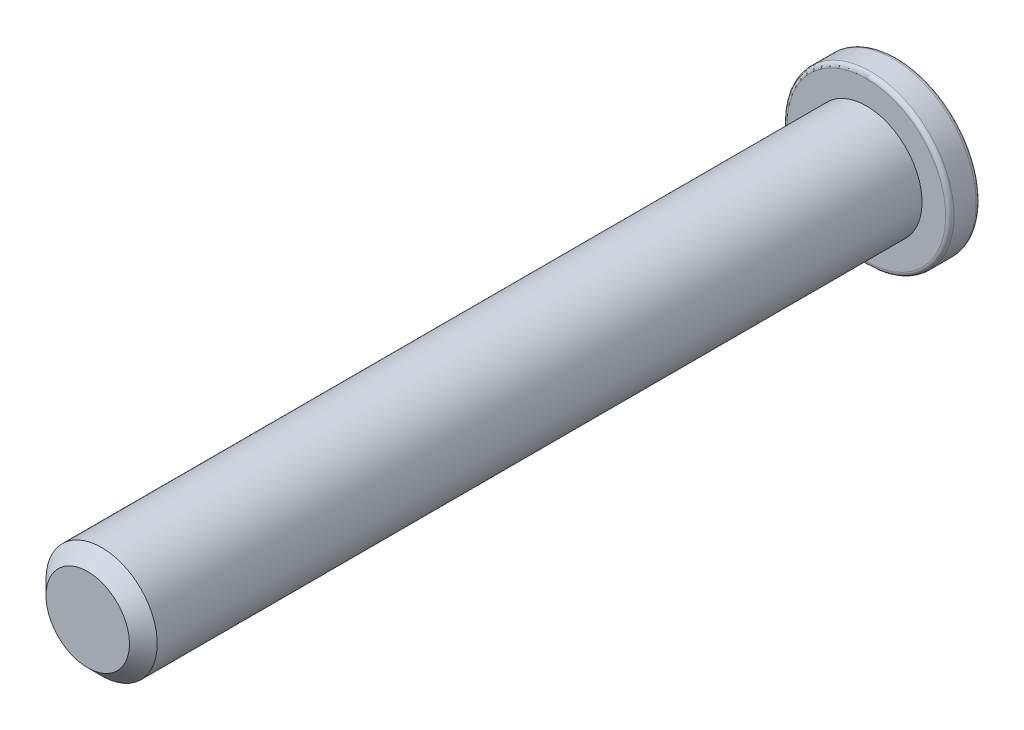
ISO-10303-21;
HEADER;
FILE_DESCRIPTION(('STEP AP214'),'2;1');
FILE_NAME('part.step','',(''),(''),'','','');
FILE_SCHEMA(('AUTOMOTIVE_DESIGN { 1 0 10303 214 1 1 1 1 }'));
ENDSEC;
DATA;
#1=APPLICATION_CONTEXT('core data for automotive mechanical design processes');
#2=APPLICATION_PROTOCOL_DEFINITION('international standard','automotive_design',2000,#1);
#3=PRODUCT_CONTEXT('',#1,'mechanical');
#4=PRODUCT('Part','Part','',(#3));
#5=PRODUCT_RELATED_PRODUCT_CATEGORY('part','',(#4));
#6=PRODUCT_DEFINITION_FORMATION('','',#4);
#7=PRODUCT_DEFINITION_CONTEXT('part definition',#1,'design');
#8=PRODUCT_DEFINITION('design','',#6,#7);
#9=PRODUCT_DEFINITION_SHAPE('','',#8);
#10=(LENGTH_UNIT() NAMED_UNIT(*) SI_UNIT(.MILLI.,.METRE.));
#11=(NAMED_UNIT(*) PLANE_ANGLE_UNIT() SI_UNIT($,.RADIAN.));
#12=(NAMED_UNIT(*) SI_UNIT($,.STERADIAN.) SOLID_ANGLE_UNIT());
#13=UNCERTAINTY_MEASURE_WITH_UNIT(LENGTH_MEASURE(1.E-05),#10,'distance_accuracy_value','');
#14=(GEOMETRIC_REPRESENTATION_CONTEXT(3) GLOBAL_UNCERTAINTY_ASSIGNED_CONTEXT((#13)) GLOBAL_UNIT_ASSIGNED_CONTEXT((#10,
#11,#12)) REPRESENTATION_CONTEXT('',''));
#15=CARTESIAN_POINT('',(0.,0.,0.));
#16=DIRECTION('',(0.,0.,1.));
#17=DIRECTION('',(1.,0.,0.));
#18=AXIS2_PLACEMENT_3D('',#15,#16,#17);
#19=CARTESIAN_POINT('',(-10.40000072,-11.25,-18.9584026755113));
#20=DIRECTION('',(-0.923879532511287,0.,-0.38268343236509));
#21=DIRECTION('',(-0.38268343236509,0.,0.923879532511287));
#22=AXIS2_PLACEMENT_3D('',#19,#20,#21);
#23=PLANE('',#22);
#24=DIRECTION('',(0.,1.,0.));
#25=VECTOR('',#24,1.);
#26=CARTESIAN_POINT('',(-10.8970569948477,-11.25,-17.7584026755113));
#27=LINE('',#26,#25);
#28=CARTESIAN_POINT('',(-10.8970569948477,-11.3660878256678,-17.7584026755113));
#29=VERTEX_POINT('',#28);
#30=CARTESIAN_POINT('',(-10.8970569948477,-11.1339121743322,-17.7584026755113));
#31=VERTEX_POINT('',#30);
#32=EDGE_CURVE('E117',#29,#31,#27,.T.);
#33=ORIENTED_EDGE('',*,*,#32,.T.);
#34=DIRECTION('',(-0.381887326256781,-0.0644695530821724,0.921957562347547));
#35=VECTOR('',#34,1.);
#36=CARTESIAN_POINT('',(-10.40000072,-11.05,-18.9584026755113));
#37=LINE('',#36,#35);
#38=CARTESIAN_POINT('',(-10.40000072,-11.05,-18.9584026755113));
#39=VERTEX_POINT('',#38);
#40=EDGE_CURVE('E133',#39,#31,#37,.T.);
#41=ORIENTED_EDGE('',*,*,#40,.F.);
#42=DIRECTION('',(0.,1.,0.));
#43=VECTOR('',#42,1.);
#44=CARTESIAN_POINT('',(-10.40000072,-11.25,-18.9584026755113));
#45=LINE('',#44,#43);
#46=CARTESIAN_POINT('',(-10.40000072,-11.45,-18.9584026755113));
#47=VERTEX_POINT('',#46);
#48=EDGE_CURVE('E122',#39,#47,#45,.F.);
#49=ORIENTED_EDGE('',*,*,#48,.T.);
#50=DIRECTION('',(0.381887326256781,-0.0644695530821737,-0.921957562347547));
#51=VECTOR('',#50,1.);
#52=CARTESIAN_POINT('',(-10.8970569948477,-11.3660878256678,-17.7584026755113));
#53=LINE('',#52,#51);
#54=EDGE_CURVE('E286',#29,#47,#53,.T.);
#55=ORIENTED_EDGE('',*,*,#54,.F.);
#56=EDGE_LOOP('',(#33,#41,#49,#55));
#57=FACE_BOUND('',#56,.T.);
#58=ADVANCED_FACE('F17',(#57),#23,.T.);
#59=CARTESIAN_POINT('',(-11.25000072,-11.05,-18.9584026755113));
#60=DIRECTION('',(0.,-0.997564050259824,-0.0697564737441253));
#61=DIRECTION('',(0.,0.0697564737441253,-0.997564050259824));
#62=AXIS2_PLACEMENT_3D('',#59,#60,#61);
#63=PLANE('',#62);
#64=DIRECTION('',(1.,0.,0.));
#65=VECTOR('',#64,1.);
#66=CARTESIAN_POINT('',(-11.25000072,-11.1339121743322,-17.7584026755113));
#67=LINE('',#66,#65);
#68=CARTESIAN_POINT('',(-11.1339128943322,-11.1339121743322,-17.7584026755113));
#69=VERTEX_POINT('',#68);
#70=EDGE_CURVE('E135',#31,#69,#67,.F.);
#71=ORIENTED_EDGE('',*,*,#70,.T.);
#72=DIRECTION('',(-0.0695873743166642,-0.0695873743166541,0.995145815783509));
#73=VECTOR('',#72,1.);
#74=CARTESIAN_POINT('',(-11.05000072,-11.05,-18.9584026755113));
#75=LINE('',#74,#73);
#76=CARTESIAN_POINT('',(-11.05000072,-11.05,-18.9584026755113));
#77=VERTEX_POINT('',#76);
#78=EDGE_CURVE('E139',#77,#69,#75,.T.);
#79=ORIENTED_EDGE('',*,*,#78,.F.);
#80=DIRECTION('',(1.,0.,0.));
#81=VECTOR('',#80,1.);
#82=CARTESIAN_POINT('',(-11.25000072,-11.05,-18.9584026755113));
#83=LINE('',#82,#81);
#84=EDGE_CURVE('E126',#77,#39,#83,.T.);
#85=ORIENTED_EDGE('',*,*,#84,.T.);
#86=ORIENTED_EDGE('',*,*,#40,.T.);
#87=EDGE_LOOP('',(#71,#79,#85,#86));
#88=FACE_BOUND('',#87,.T.);
#89=ADVANCED_FACE('F137',(#88),#63,.T.);
#90=CARTESIAN_POINT('',(-11.25000072,-11.45,-18.9584026755113));
#91=DIRECTION('',(0.,0.997564050259824,-0.0697564737441253));
#92=DIRECTION('',(0.,0.0697564737441253,0.997564050259824));
#93=AXIS2_PLACEMENT_3D('',#90,#91,#92);
#94=PLANE('',#93);
#95=DIRECTION('',(1.,0.,0.));
#96=VECTOR('',#95,1.);
#97=CARTESIAN_POINT('',(-11.25000072,-11.3660878256678,-17.7584026755113));
#98=LINE('',#97,#96);
#99=CARTESIAN_POINT('',(-11.1339128943322,-11.3660878256678,-17.7584026755113));
#100=VERTEX_POINT('',#99);
#101=EDGE_CURVE('E288',#100,#29,#98,.T.);
#102=ORIENTED_EDGE('',*,*,#101,.T.);
#103=ORIENTED_EDGE('',*,*,#54,.T.);
#104=DIRECTION('',(1.,0.,0.));
#105=VECTOR('',#104,1.);
#106=CARTESIAN_POINT('',(-11.25000072,-11.45,-18.9584026755113));
#107=LINE('',#106,#105);
#108=CARTESIAN_POINT('',(-11.05000072,-11.45,-18.9584026755113));
#109=VERTEX_POINT('',#108);
#110=EDGE_CURVE('E129',#47,#109,#107,.F.);
#111=ORIENTED_EDGE('',*,*,#110,.T.);
#112=DIRECTION('',(0.0695873743166642,-0.0695873743166541,-0.995145815783509));
#113=VECTOR('',#112,1.);
#114=CARTESIAN_POINT('',(-11.1339128943322,-11.3660878256678,-17.7584026755113));
#115=LINE('',#114,#113);
#116=EDGE_CURVE('E272',#100,#109,#115,.T.);
#117=ORIENTED_EDGE('',*,*,#116,.F.);
#118=EDGE_LOOP('',(#102,#103,#111,#117));
#119=FACE_BOUND('',#118,.T.);
#120=ADVANCED_FACE('F459',(#119),#94,.T.);
#121=CARTESIAN_POINT('',(-11.05000072,-11.25,-18.9584026755113));
#122=DIRECTION('',(-0.997564050259824,0.,-0.0697564737441253));
#123=DIRECTION('',(-0.0697564737441253,0.,0.997564050259824));
#124=AXIS2_PLACEMENT_3D('',#121,#122,#123);
#125=PLANE('',#124);
#126=DIRECTION('',(0.,1.,0.));
#127=VECTOR('',#126,1.);
#128=CARTESIAN_POINT('',(-11.1339128943322,-11.25,-17.7584026755113));
#129=LINE('',#128,#127);
#130=CARTESIAN_POINT('',(-11.1339128943322,-10.8970562748477,-17.7584026755113));
#131=VERTEX_POINT('',#130);
#132=EDGE_CURVE('E281',#69,#131,#129,.T.);
#133=ORIENTED_EDGE('',*,*,#132,.T.);
#134=DIRECTION('',(-0.0644695530821645,-0.381887326256792,0.921957562347544));
#135=VECTOR('',#134,1.);
#136=CARTESIAN_POINT('',(-11.05000072,-10.4,-18.9584026755113));
#137=LINE('',#136,#135);
#138=CARTESIAN_POINT('',(-11.05000072,-10.4,-18.9584026755113));
#139=VERTEX_POINT('',#138);
#140=EDGE_CURVE('E266',#139,#131,#137,.T.);
#141=ORIENTED_EDGE('',*,*,#140,.F.);
#142=DIRECTION('',(0.,1.,0.));
#143=VECTOR('',#142,1.);
#144=CARTESIAN_POINT('',(-11.05000072,-11.25,-18.9584026755113));
#145=LINE('',#144,#143);
#146=EDGE_CURVE('E284',#139,#77,#145,.F.);
#147=ORIENTED_EDGE('',*,*,#146,.T.);
#148=ORIENTED_EDGE('',*,*,#78,.T.);
#149=EDGE_LOOP('',(#133,#141,#147,#148));
#150=FACE_BOUND('',#149,.T.);
#151=ADVANCED_FACE('F298',(#150),#125,.T.);
#152=CARTESIAN_POINT('',(-11.05000072,-11.25,-18.9584026755113));
#153=DIRECTION('',(-0.997564050259824,0.,-0.0697564737441253));
#154=DIRECTION('',(-0.0697564737441253,0.,0.997564050259824));
#155=AXIS2_PLACEMENT_3D('',#152,#153,#154);
#156=PLANE('',#155);
#157=DIRECTION('',(0.,1.,0.));
#158=VECTOR('',#157,1.);
#159=CARTESIAN_POINT('',(-11.1339128943322,-11.25,-17.7584026755113));
#160=LINE('',#159,#158);
#161=CARTESIAN_POINT('',(-11.1339128943322,-11.6029437251523,-17.7584026755113));
#162=VERTEX_POINT('',#161);
#163=EDGE_CURVE('E275',#162,#100,#160,.T.);
#164=ORIENTED_EDGE('',*,*,#163,.T.);
#165=ORIENTED_EDGE('',*,*,#116,.T.);
#166=DIRECTION('',(0.,1.,0.));
#167=VECTOR('',#166,1.);
#168=CARTESIAN_POINT('',(-11.05000072,-11.25,-18.9584026755113));
#169=LINE('',#168,#167);
#170=CARTESIAN_POINT('',(-11.05000072,-12.1,-18.9584026755113));
#171=VERTEX_POINT('',#170);
#172=EDGE_CURVE('E278',#109,#171,#169,.F.);
#173=ORIENTED_EDGE('',*,*,#172,.T.);
#174=DIRECTION('',(0.0644695530821645,-0.381887326256792,-0.921957562347544));
#175=VECTOR('',#174,1.);
#176=CARTESIAN_POINT('',(-11.1339128943322,-11.6029437251523,-17.7584026755113));
#177=LINE('',#176,#175);
#178=EDGE_CURVE('E255',#162,#171,#177,.T.);
#179=ORIENTED_EDGE('',*,*,#178,.F.);
#180=EDGE_LOOP('',(#164,#165,#173,#179));
#181=FACE_BOUND('',#180,.T.);
#182=ADVANCED_FACE('F445',(#181),#156,.T.);
#183=CARTESIAN_POINT('',(-11.25000072,-10.4,-18.9584026755113));
#184=DIRECTION('',(0.,-0.923879532511287,-0.38268343236509));
#185=DIRECTION('',(0.,0.38268343236509,-0.923879532511287));
#186=AXIS2_PLACEMENT_3D('',#183,#184,#185);
#187=PLANE('',#186);
#188=DIRECTION('',(1.,0.,0.));
#189=VECTOR('',#188,1.);
#190=CARTESIAN_POINT('',(-11.25000072,-10.8970562748477,-17.7584026755113));
#191=LINE('',#190,#189);
#192=CARTESIAN_POINT('',(-11.3660885456678,-10.8970562748477,-17.7584026755113));
#193=VERTEX_POINT('',#192);
#194=EDGE_CURVE('E264',#131,#193,#191,.F.);
#195=ORIENTED_EDGE('',*,*,#194,.T.);
#196=DIRECTION('',(0.0644695530821724,-0.381887326256779,0.921957562347548));
#197=VECTOR('',#196,1.);
#198=CARTESIAN_POINT('',(-11.45000072,-10.4,-18.9584026755113));
#199=LINE('',#198,#197);
#200=CARTESIAN_POINT('',(-11.45000072,-10.4,-18.9584026755113));
#201=VERTEX_POINT('',#200);
#202=EDGE_CURVE('E249',#201,#193,#199,.T.);
#203=ORIENTED_EDGE('',*,*,#202,.F.);
#204=DIRECTION('',(1.,0.,0.));
#205=VECTOR('',#204,1.);
#206=CARTESIAN_POINT('',(-11.25000072,-10.4,-18.9584026755113));
#207=LINE('',#206,#205);
#208=EDGE_CURVE('E269',#201,#139,#207,.T.);
#209=ORIENTED_EDGE('',*,*,#208,.T.);
#210=ORIENTED_EDGE('',*,*,#140,.T.);
#211=EDGE_LOOP('',(#195,#203,#209,#210));
#212=FACE_BOUND('',#211,.T.);
#213=ADVANCED_FACE('F302',(#212),#187,.T.);
#214=CARTESIAN_POINT('',(-11.25000072,-12.1,-18.9584026755113));
#215=DIRECTION('',(0.,0.923879532511287,-0.38268343236509));
#216=DIRECTION('',(0.,0.38268343236509,0.923879532511287));
#217=AXIS2_PLACEMENT_3D('',#214,#215,#216);
#218=PLANE('',#217);
#219=DIRECTION('',(1.,0.,0.));
#220=VECTOR('',#219,1.);
#221=CARTESIAN_POINT('',(-11.25000072,-11.6029437251523,-17.7584026755113));
#222=LINE('',#221,#220);
#223=CARTESIAN_POINT('',(-11.3660885456678,-11.6029437251523,-17.7584026755113));
#224=VERTEX_POINT('',#223);
#225=EDGE_CURVE('E258',#224,#162,#222,.T.);
#226=ORIENTED_EDGE('',*,*,#225,.T.);
#227=ORIENTED_EDGE('',*,*,#178,.T.);
#228=DIRECTION('',(1.,0.,0.));
#229=VECTOR('',#228,1.);
#230=CARTESIAN_POINT('',(-11.25000072,-12.1,-18.9584026755113));
#231=LINE('',#230,#229);
#232=CARTESIAN_POINT('',(-11.45000072,-12.1,-18.9584026755113));
#233=VERTEX_POINT('',#232);
#234=EDGE_CURVE('E261',#171,#233,#231,.F.);
#235=ORIENTED_EDGE('',*,*,#234,.T.);
#236=DIRECTION('',(-0.0644695530821738,-0.38188732625678,-0.921957562347548));
#237=VECTOR('',#236,1.);
#238=CARTESIAN_POINT('',(-11.3660885456678,-11.6029437251523,-17.7584026755113));
#239=LINE('',#238,#237);
#240=EDGE_CURVE('E241',#224,#233,#239,.T.);
#241=ORIENTED_EDGE('',*,*,#240,.F.);
#242=EDGE_LOOP('',(#226,#227,#235,#241));
#243=FACE_BOUND('',#242,.T.);
#244=ADVANCED_FACE('F431',(#243),#218,.T.);
#245=CARTESIAN_POINT('',(-11.45000072,-11.25,-18.9584026755113));
#246=DIRECTION('',(0.997564050259824,0.,-0.0697564737441253));
#247=DIRECTION('',(-0.0697564737441253,0.,-0.997564050259824));
#248=AXIS2_PLACEMENT_3D('',#245,#246,#247);
#249=PLANE('',#248);
#250=DIRECTION('',(0.,1.,0.));
#251=VECTOR('',#250,1.);
#252=CARTESIAN_POINT('',(-11.3660885456678,-11.25,-17.7584026755113));
#253=LINE('',#252,#251);
#254=CARTESIAN_POINT('',(-11.3660885456678,-11.1339121743322,-17.7584026755113));
#255=VERTEX_POINT('',#254);
#256=EDGE_CURVE('E247',#193,#255,#253,.F.);
#257=ORIENTED_EDGE('',*,*,#256,.T.);
#258=DIRECTION('',(0.0695873743166541,-0.0695873743166642,0.995145815783509));
#259=VECTOR('',#258,1.);
#260=CARTESIAN_POINT('',(-11.45000072,-11.05,-18.9584026755113));
#261=LINE('',#260,#259);
#262=CARTESIAN_POINT('',(-11.45000072,-11.05,-18.9584026755113));
#263=VERTEX_POINT('',#262);
#264=EDGE_CURVE('E235',#263,#255,#261,.T.);
#265=ORIENTED_EDGE('',*,*,#264,.F.);
#266=DIRECTION('',(0.,1.,0.));
#267=VECTOR('',#266,1.);
#268=CARTESIAN_POINT('',(-11.45000072,-11.25,-18.9584026755113));
#269=LINE('',#268,#267);
#270=EDGE_CURVE('E252',#263,#201,#269,.T.);
#271=ORIENTED_EDGE('',*,*,#270,.T.);
#272=ORIENTED_EDGE('',*,*,#202,.T.);
#273=EDGE_LOOP('',(#257,#265,#271,#272));
#274=FACE_BOUND('',#273,.T.);
#275=ADVANCED_FACE('F304',(#274),#249,.T.);
#276=CARTESIAN_POINT('',(-11.45000072,-11.25,-18.9584026755113));
#277=DIRECTION('',(0.997564050259824,0.,-0.0697564737441253));
#278=DIRECTION('',(-0.0697564737441253,0.,-0.997564050259824));
#279=AXIS2_PLACEMENT_3D('',#276,#277,#278);
#280=PLANE('',#279);
#281=DIRECTION('',(0.,1.,0.));
#282=VECTOR('',#281,1.);
#283=CARTESIAN_POINT('',(-11.3660885456678,-11.25,-17.7584026755113));
#284=LINE('',#283,#282);
#285=CARTESIAN_POINT('',(-11.3660885456678,-11.3660878256678,-17.7584026755113));
#286=VERTEX_POINT('',#285);
#287=EDGE_CURVE('E230',#224,#286,#284,.T.);
#288=ORIENTED_EDGE('',*,*,#287,.F.);
#289=ORIENTED_EDGE('',*,*,#240,.T.);
#290=DIRECTION('',(0.,1.,0.));
#291=VECTOR('',#290,1.);
#292=CARTESIAN_POINT('',(-11.45000072,-11.25,-18.9584026755113));
#293=LINE('',#292,#291);
#294=CARTESIAN_POINT('',(-11.45000072,-11.45,-18.9584026755113));
#295=VERTEX_POINT('',#294);
#296=EDGE_CURVE('E244',#233,#295,#293,.T.);
#297=ORIENTED_EDGE('',*,*,#296,.T.);
#298=DIRECTION('',(-0.0695873743166541,-0.0695873743166642,-0.995145815783509));
#299=VECTOR('',#298,1.);
#300=CARTESIAN_POINT('',(-11.3660885456678,-11.3660878256678,-17.7584026755113));
#301=LINE('',#300,#299);
#302=EDGE_CURVE('E222',#286,#295,#301,.T.);
#303=ORIENTED_EDGE('',*,*,#302,.F.);
#304=EDGE_LOOP('',(#288,#289,#297,#303));
#305=FACE_BOUND('',#304,.T.);
#306=ADVANCED_FACE('F417',(#305),#280,.T.);
#307=CARTESIAN_POINT('',(-11.25000072,-11.05,-18.9584026755113));
#308=DIRECTION('',(0.,-0.997564050259824,-0.0697564737441253));
#309=DIRECTION('',(0.,0.0697564737441253,-0.997564050259824));
#310=AXIS2_PLACEMENT_3D('',#307,#308,#309);
#311=PLANE('',#310);
#312=DIRECTION('',(-1.,0.,0.));
#313=VECTOR('',#312,1.);
#314=CARTESIAN_POINT('',(-11.25000072,-11.1339121743322,-17.7584026755113));
#315=LINE('',#314,#313);
#316=CARTESIAN_POINT('',(-11.6029444451523,-11.1339121743322,-17.7584026755113));
#317=VERTEX_POINT('',#316);
#318=EDGE_CURVE('E232',#317,#255,#315,.F.);
#319=ORIENTED_EDGE('',*,*,#318,.F.);
#320=DIRECTION('',(0.381887326256792,-0.0644695530821645,0.921957562347544));
#321=VECTOR('',#320,1.);
#322=CARTESIAN_POINT('',(-12.10000072,-11.05,-18.9584026755113));
#323=LINE('',#322,#321);
#324=CARTESIAN_POINT('',(-12.10000072,-11.05,-18.9584026755113));
#325=VERTEX_POINT('',#324);
#326=EDGE_CURVE('E219',#325,#317,#323,.T.);
#327=ORIENTED_EDGE('',*,*,#326,.F.);
#328=DIRECTION('',(1.,0.,0.));
#329=VECTOR('',#328,1.);
#330=CARTESIAN_POINT('',(-11.25000072,-11.05,-18.9584026755113));
#331=LINE('',#330,#329);
#332=EDGE_CURVE('E238',#325,#263,#331,.T.);
#333=ORIENTED_EDGE('',*,*,#332,.T.);
#334=ORIENTED_EDGE('',*,*,#264,.T.);
#335=EDGE_LOOP('',(#319,#327,#333,#334));
#336=FACE_BOUND('',#335,.T.);
#337=ADVANCED_FACE('F307',(#336),#311,.T.);
#338=CARTESIAN_POINT('',(-11.25000072,-11.25,-17.7584026755113));
#339=DIRECTION('',(0.,0.,-1.));
#340=DIRECTION('',(-1.,0.,0.));
#341=AXIS2_PLACEMENT_3D('',#338,#339,#340);
#342=PLANE('',#341);
#343=ORIENTED_EDGE('',*,*,#225,.F.);
#344=ORIENTED_EDGE('',*,*,#287,.T.);
#345=DIRECTION('',(1.,0.,0.));
#346=VECTOR('',#345,1.);
#347=CARTESIAN_POINT('',(-11.25000072,-11.3660878256678,-17.7584026755113));
#348=LINE('',#347,#346);
#349=CARTESIAN_POINT('',(-11.6029444451523,-11.3660878256678,-17.7584026755113));
#350=VERTEX_POINT('',#349);
#351=EDGE_CURVE('E225',#350,#286,#348,.T.);
#352=ORIENTED_EDGE('',*,*,#351,.F.);
#353=DIRECTION('',(0.,1.,0.));
#354=VECTOR('',#353,1.);
#355=CARTESIAN_POINT('',(-11.6029444451523,-11.25,-17.7584026755113));
#356=LINE('',#355,#354);
#357=EDGE_CURVE('E216',#317,#350,#356,.F.);
#358=ORIENTED_EDGE('',*,*,#357,.F.);
#359=ORIENTED_EDGE('',*,*,#318,.T.);
#360=ORIENTED_EDGE('',*,*,#256,.F.);
#361=ORIENTED_EDGE('',*,*,#194,.F.);
#362=ORIENTED_EDGE('',*,*,#132,.F.);
#363=ORIENTED_EDGE('',*,*,#70,.F.);
#364=ORIENTED_EDGE('',*,*,#32,.F.);
#365=ORIENTED_EDGE('',*,*,#101,.F.);
#366=ORIENTED_EDGE('',*,*,#163,.F.);
#367=EDGE_LOOP('',(#343,#344,#352,#358,#359,#360,#361,#362,#363,#364,#365,#366));
#368=FACE_BOUND('',#367,.T.);
#369=ADVANCED_FACE('F294',(#368),#342,.T.);
#370=CARTESIAN_POINT('',(-11.25000072,-11.45,-18.9584026755113));
#371=DIRECTION('',(0.,0.997564050259824,-0.0697564737441253));
#372=DIRECTION('',(0.,0.0697564737441253,0.997564050259824));
#373=AXIS2_PLACEMENT_3D('',#370,#371,#372);
#374=PLANE('',#373);
#375=ORIENTED_EDGE('',*,*,#351,.T.);
#376=ORIENTED_EDGE('',*,*,#302,.T.);
#377=DIRECTION('',(1.,0.,0.));
#378=VECTOR('',#377,1.);
#379=CARTESIAN_POINT('',(-11.25000072,-11.45,-18.9584026755113));
#380=LINE('',#379,#378);
#381=CARTESIAN_POINT('',(-12.10000072,-11.45,-18.9584026755113));
#382=VERTEX_POINT('',#381);
#383=EDGE_CURVE('E228',#295,#382,#380,.F.);
#384=ORIENTED_EDGE('',*,*,#383,.T.);
#385=DIRECTION('',(-0.381887326256792,-0.0644695530821645,-0.921957562347544));
#386=VECTOR('',#385,1.);
#387=CARTESIAN_POINT('',(-11.6029444451523,-11.3660878256678,-17.7584026755113));
#388=LINE('',#387,#386);
#389=EDGE_CURVE('E207',#350,#382,#388,.T.);
#390=ORIENTED_EDGE('',*,*,#389,.F.);
#391=EDGE_LOOP('',(#375,#376,#384,#390));
#392=FACE_BOUND('',#391,.T.);
#393=ADVANCED_FACE('F336',(#392),#374,.T.);
#394=CARTESIAN_POINT('',(-12.10000072,-11.25,-18.9584026755113));
#395=DIRECTION('',(0.923879532511287,0.,-0.38268343236509));
#396=DIRECTION('',(-0.38268343236509,0.,-0.923879532511287));
#397=AXIS2_PLACEMENT_3D('',#394,#395,#396);
#398=PLANE('',#397);
#399=ORIENTED_EDGE('',*,*,#357,.T.);
#400=ORIENTED_EDGE('',*,*,#389,.T.);
#401=DIRECTION('',(0.,1.,0.));
#402=VECTOR('',#401,1.);
#403=CARTESIAN_POINT('',(-12.10000072,-11.25,-18.9584026755113));
#404=LINE('',#403,#402);
#405=EDGE_CURVE('E215',#382,#325,#404,.T.);
#406=ORIENTED_EDGE('',*,*,#405,.T.);
#407=ORIENTED_EDGE('',*,*,#326,.T.);
#408=EDGE_LOOP('',(#399,#400,#406,#407));
#409=FACE_BOUND('',#408,.T.);
#410=ADVANCED_FACE('F331',(#409),#398,.T.);
#411=CARTESIAN_POINT('',(-11.25000072,-11.25,-18.9584026755113));
#412=DIRECTION('',(0.,0.,1.));
#413=DIRECTION('',(1.,0.,0.));
#414=AXIS2_PLACEMENT_3D('',#411,#412,#413);
#415=PLANE('',#414);
#416=ORIENTED_EDGE('',*,*,#383,.F.);
#417=ORIENTED_EDGE('',*,*,#296,.F.);
#418=ORIENTED_EDGE('',*,*,#234,.F.);
#419=ORIENTED_EDGE('',*,*,#172,.F.);
#420=ORIENTED_EDGE('',*,*,#110,.F.);
#421=ORIENTED_EDGE('',*,*,#48,.F.);
#422=ORIENTED_EDGE('',*,*,#84,.F.);
#423=ORIENTED_EDGE('',*,*,#146,.F.);
#424=ORIENTED_EDGE('',*,*,#208,.F.);
#425=ORIENTED_EDGE('',*,*,#270,.F.);
#426=ORIENTED_EDGE('',*,*,#332,.F.);
#427=ORIENTED_EDGE('',*,*,#405,.F.);
#428=EDGE_LOOP('',(#416,#417,#418,#419,#420,#421,#422,#423,#424,#425,#426,#427));
#429=FACE_BOUND('',#428,.T.);
#430=CARTESIAN_POINT('',(-11.25000072,-11.25,-18.9584026755113));
#431=DIRECTION('',(0.,0.,1.));
#432=DIRECTION('',(-1.,0.,0.));
#433=AXIS2_PLACEMENT_3D('',#430,#431,#432);
#434=CIRCLE('',#433,1.425);
#435=CARTESIAN_POINT('',(-12.67500072,-11.25,-18.9584026755113));
#436=VERTEX_POINT('',#435);
#437=CARTESIAN_POINT('',(-9.82500072,-11.25,-18.9584026755113));
#438=VERTEX_POINT('',#437);
#439=EDGE_CURVE('E311',#436,#438,#434,.T.);
#440=ORIENTED_EDGE('',*,*,#439,.F.);
#441=CARTESIAN_POINT('',(-11.25000072,-11.25,-18.9584026755113));
#442=DIRECTION('',(0.,0.,1.));
#443=DIRECTION('',(1.,0.,0.));
#444=AXIS2_PLACEMENT_3D('',#441,#442,#443);
#445=CIRCLE('',#444,1.425);
#446=EDGE_CURVE('E187',#438,#436,#445,.T.);
#447=ORIENTED_EDGE('',*,*,#446,.F.);
#448=EDGE_LOOP('',(#440,#447));
#449=FACE_BOUND('',#448,.T.);
#450=ADVANCED_FACE('F123',(#429,#449),#415,.F.);
#451=CARTESIAN_POINT('',(-11.25000072,-11.25,-18.8834026755113));
#452=DIRECTION('',(0.,0.,1.));
#453=DIRECTION('',(-1.,0.,0.));
#454=AXIS2_PLACEMENT_3D('',#451,#452,#453);
#455=TOROIDAL_SURFACE('',#454,1.425,0.075);
#456=CARTESIAN_POINT('',(-11.25000072,-11.25,-18.8834026755113));
#457=DIRECTION('',(0.,0.,-1.));
#458=DIRECTION('',(-1.,0.,0.));
#459=AXIS2_PLACEMENT_3D('',#456,#457,#458);
#460=CIRCLE('',#459,1.5);
#461=CARTESIAN_POINT('',(-12.75000072,-11.25,-18.8834026755113));
#462=VERTEX_POINT('',#461);
#463=EDGE_CURVE('E184',#462,#462,#460,.F.);
#464=ORIENTED_EDGE('',*,*,#463,.F.);
#465=EDGE_LOOP('',(#464));
#466=FACE_BOUND('',#465,.T.);
#467=ORIENTED_EDGE('',*,*,#446,.T.);
#468=ORIENTED_EDGE('',*,*,#439,.T.);
#469=EDGE_LOOP('',(#467,#468));
#470=FACE_BOUND('',#469,.T.);
#471=ADVANCED_FACE('F191',(#466,#470),#455,.T.);
#472=CARTESIAN_POINT('',(-11.25000072,-11.25,-18.4084026755113));
#473=DIRECTION('',(0.,0.,-1.));
#474=DIRECTION('',(-1.,0.,0.));
#475=AXIS2_PLACEMENT_3D('',#472,#473,#474);
#476=CYLINDRICAL_SURFACE('',#475,1.5);
#477=ORIENTED_EDGE('',*,*,#463,.T.);
#478=EDGE_LOOP('',(#477));
#479=FACE_BOUND('',#478,.T.);
#480=CARTESIAN_POINT('',(-11.25000072,-11.25,-18.4834026755113));
#481=DIRECTION('',(0.,0.,1.));
#482=DIRECTION('',(-1.,0.,0.));
#483=AXIS2_PLACEMENT_3D('',#480,#481,#482);
#484=CIRCLE('',#483,1.5);
#485=CARTESIAN_POINT('',(-12.75000072,-11.25,-18.4834026755113));
#486=VERTEX_POINT('',#485);
#487=EDGE_CURVE('E149',#486,#486,#484,.T.);
#488=ORIENTED_EDGE('',*,*,#487,.F.);
#489=EDGE_LOOP('',(#488));
#490=FACE_BOUND('',#489,.T.);
#491=ADVANCED_FACE('F195',(#479,#490),#476,.T.);
#492=CARTESIAN_POINT('',(-11.25000072,-11.25,-4.40840267551127));
#493=DIRECTION('',(0.,0.,1.));
#494=DIRECTION('',(1.,0.,0.));
#495=AXIS2_PLACEMENT_3D('',#492,#493,#494);
#496=PLANE('',#495);
#497=CARTESIAN_POINT('',(-11.25000072,-11.25,-4.40840267555132));
#498=DIRECTION('',(0.,0.,-1.));
#499=DIRECTION('',(-1.,0.,0.));
#500=AXIS2_PLACEMENT_3D('',#497,#498,#499);
#501=CIRCLE('',#500,0.749999999985332);
#502=CARTESIAN_POINT('',(-12.0000007199853,-11.25,-4.40840267555132));
#503=VERTEX_POINT('',#502);
#504=EDGE_CURVE('E145',#503,#503,#501,.T.);
#505=ORIENTED_EDGE('',*,*,#504,.F.);
#506=EDGE_LOOP('',(#505));
#507=FACE_BOUND('',#506,.T.);
#508=ADVANCED_FACE('F166',(#507),#496,.T.);
#509=CARTESIAN_POINT('',(-11.25000072,-11.25,-18.4834026755113));
#510=DIRECTION('',(0.,0.,1.));
#511=DIRECTION('',(-1.,0.,0.));
#512=AXIS2_PLACEMENT_3D('',#509,#510,#511);
#513=TOROIDAL_SURFACE('',#512,1.425,0.075);
#514=CARTESIAN_POINT('',(-11.25000072,-11.25,-18.4084026755113));
#515=DIRECTION('',(0.,0.,-1.));
#516=DIRECTION('',(1.,0.,0.));
#517=AXIS2_PLACEMENT_3D('',#514,#515,#516);
#518=CIRCLE('',#517,1.425);
#519=CARTESIAN_POINT('',(-12.67500072,-11.25,-18.4084026755113));
#520=VERTEX_POINT('',#519);
#521=CARTESIAN_POINT('',(-9.82500072,-11.25,-18.4084026755113));
#522=VERTEX_POINT('',#521);
#523=EDGE_CURVE('E148',#520,#522,#518,.F.);
#524=ORIENTED_EDGE('',*,*,#523,.F.);
#525=CARTESIAN_POINT('',(-11.25000072,-11.25,-18.4084026755113));
#526=DIRECTION('',(0.,0.,-1.));
#527=DIRECTION('',(-1.,0.,0.));
#528=AXIS2_PLACEMENT_3D('',#525,#526,#527);
#529=CIRCLE('',#528,1.425);
#530=EDGE_CURVE('E36',#522,#520,#529,.F.);
#531=ORIENTED_EDGE('',*,*,#530,.F.);
#532=EDGE_LOOP('',(#524,#531));
#533=FACE_BOUND('',#532,.T.);
#534=ORIENTED_EDGE('',*,*,#487,.T.);
#535=EDGE_LOOP('',(#534));
#536=FACE_BOUND('',#535,.T.);
#537=ADVANCED_FACE('F154',(#533,#536),#513,.T.);
#538=CARTESIAN_POINT('',(-11.25000072,-11.25,-4.65840267577278));
#539=DIRECTION('',(0.,0.,-1.));
#540=DIRECTION('',(-1.,0.,0.));
#541=AXIS2_PLACEMENT_3D('',#538,#539,#540);
#542=CONICAL_SURFACE('',#541,0.999999999752046,0.785398162487954);
#543=ORIENTED_EDGE('',*,*,#504,.T.);
#544=EDGE_LOOP('',(#543));
#545=FACE_BOUND('',#544,.T.);
#546=CARTESIAN_POINT('',(-11.25000072,-11.25,-4.65840267551127));
#547=DIRECTION('',(0.,0.,-1.));
#548=DIRECTION('',(-1.,0.,0.));
#549=AXIS2_PLACEMENT_3D('',#546,#547,#548);
#550=CIRCLE('',#549,1.);
#551=CARTESIAN_POINT('',(-12.25000072,-11.25,-4.65840267551127));
#552=VERTEX_POINT('',#551);
#553=EDGE_CURVE('E28',#552,#552,#550,.T.);
#554=ORIENTED_EDGE('',*,*,#553,.F.);
#555=EDGE_LOOP('',(#554));
#556=FACE_BOUND('',#555,.T.);
#557=ADVANCED_FACE('F165',(#545,#556),#542,.T.);
#558=CARTESIAN_POINT('',(-11.25000072,-11.25,-18.4084026755113));
#559=DIRECTION('',(0.,0.,1.));
#560=DIRECTION('',(1.,0.,0.));
#561=AXIS2_PLACEMENT_3D('',#558,#559,#560);
#562=PLANE('',#561);
#563=CARTESIAN_POINT('',(-11.25000072,-11.25,-18.4084026755113));
#564=DIRECTION('',(0.,0.,-1.));
#565=DIRECTION('',(-1.,0.,0.));
#566=AXIS2_PLACEMENT_3D('',#563,#564,#565);
#567=CIRCLE('',#566,1.);
#568=CARTESIAN_POINT('',(-12.25000072,-11.25,-18.4084026755113));
#569=VERTEX_POINT('',#568);
#570=EDGE_CURVE('E11',#569,#569,#567,.F.);
#571=ORIENTED_EDGE('',*,*,#570,.F.);
#572=EDGE_LOOP('',(#571));
#573=FACE_BOUND('',#572,.T.);
#574=ORIENTED_EDGE('',*,*,#523,.T.);
#575=ORIENTED_EDGE('',*,*,#530,.T.);
#576=EDGE_LOOP('',(#574,#575));
#577=FACE_BOUND('',#576,.T.);
#578=ADVANCED_FACE('F339',(#573,#577),#562,.T.);
#579=CARTESIAN_POINT('',(-11.25000072,-11.25,-4.40840267551127));
#580=DIRECTION('',(0.,0.,-1.));
#581=DIRECTION('',(-1.,0.,0.));
#582=AXIS2_PLACEMENT_3D('',#579,#580,#581);
#583=CYLINDRICAL_SURFACE('',#582,1.);
#584=ORIENTED_EDGE('',*,*,#553,.T.);
#585=EDGE_LOOP('',(#584));
#586=FACE_BOUND('',#585,.T.);
#587=ORIENTED_EDGE('',*,*,#570,.T.);
#588=EDGE_LOOP('',(#587));
#589=FACE_BOUND('',#588,.T.);
#590=ADVANCED_FACE('F337',(#586,#589),#583,.T.);
#591=CLOSED_SHELL('',(#58,#89,#120,#151,#182,#213,#244,#275,#306,#337,#369,#393,#410,#450,#471,
#491,#508,#537,#557,#578,#590));
#592=MANIFOLD_SOLID_BREP('B1',#591);
#593=ADVANCED_BREP_SHAPE_REPRESENTATION('',(#18,#592),#14);
#594=SHAPE_DEFINITION_REPRESENTATION(#9,#593);
ENDSEC;
END-ISO-10303-21;
